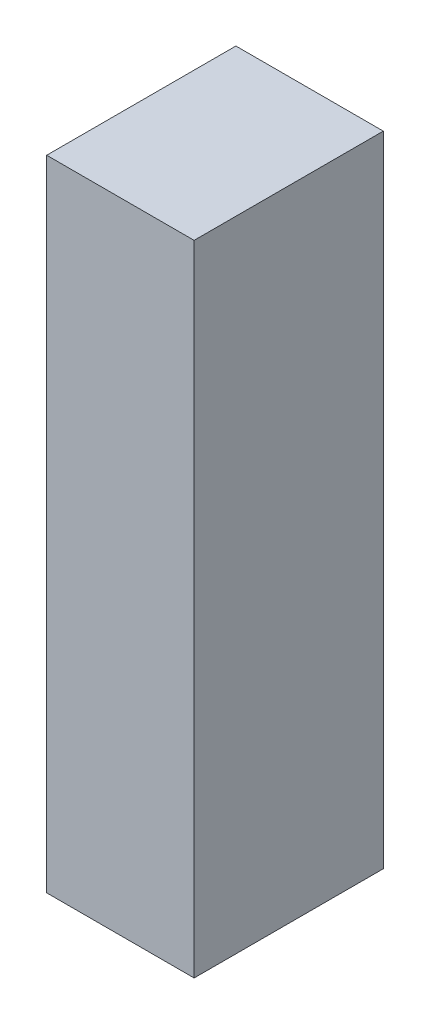
ISO-10303-21;
HEADER;
FILE_DESCRIPTION(('STEP AP214'),'2;1');
FILE_NAME('part.step','',(''),(''),'','','');
FILE_SCHEMA(('AUTOMOTIVE_DESIGN { 1 0 10303 214 1 1 1 1 }'));
ENDSEC;
DATA;
#1=APPLICATION_CONTEXT('core data for automotive mechanical design processes');
#2=APPLICATION_PROTOCOL_DEFINITION('international standard','automotive_design',2000,#1);
#3=PRODUCT_CONTEXT('',#1,'mechanical');
#4=PRODUCT('Part','Part','',(#3));
#5=PRODUCT_RELATED_PRODUCT_CATEGORY('part','',(#4));
#6=PRODUCT_DEFINITION_FORMATION('','',#4);
#7=PRODUCT_DEFINITION_CONTEXT('part definition',#1,'design');
#8=PRODUCT_DEFINITION('design','',#6,#7);
#9=PRODUCT_DEFINITION_SHAPE('','',#8);
#10=(LENGTH_UNIT() NAMED_UNIT(*) SI_UNIT(.MILLI.,.METRE.));
#11=(NAMED_UNIT(*) PLANE_ANGLE_UNIT() SI_UNIT($,.RADIAN.));
#12=(NAMED_UNIT(*) SI_UNIT($,.STERADIAN.) SOLID_ANGLE_UNIT());
#13=UNCERTAINTY_MEASURE_WITH_UNIT(LENGTH_MEASURE(1.E-05),#10,'distance_accuracy_value','');
#14=(GEOMETRIC_REPRESENTATION_CONTEXT(3) GLOBAL_UNCERTAINTY_ASSIGNED_CONTEXT((#13)) GLOBAL_UNIT_ASSIGNED_CONTEXT((#10,
#11,#12)) REPRESENTATION_CONTEXT('',''));
#15=CARTESIAN_POINT('',(0.,0.,0.));
#16=DIRECTION('',(0.,0.,1.));
#17=DIRECTION('',(1.,0.,0.));
#18=AXIS2_PLACEMENT_3D('',#15,#16,#17);
#19=CARTESIAN_POINT('',(-150.,1300.,-192.5));
#20=DIRECTION('',(1.,0.,0.));
#21=DIRECTION('',(0.,0.,-1.));
#22=AXIS2_PLACEMENT_3D('',#19,#20,#21);
#23=PLANE('',#22);
#24=DIRECTION('',(0.,0.,1.));
#25=VECTOR('',#24,1.);
#26=CARTESIAN_POINT('',(-150.,0.,-192.5));
#27=LINE('',#26,#25);
#28=CARTESIAN_POINT('',(-150.,0.,-192.5));
#29=VERTEX_POINT('',#28);
#30=CARTESIAN_POINT('',(-150.,0.,192.5));
#31=VERTEX_POINT('',#30);
#32=EDGE_CURVE('E111',#29,#31,#27,.T.);
#33=ORIENTED_EDGE('',*,*,#32,.T.);
#34=DIRECTION('',(0.,-1.,0.));
#35=VECTOR('',#34,1.);
#36=CARTESIAN_POINT('',(-150.,1300.,192.5));
#37=LINE('',#36,#35);
#38=CARTESIAN_POINT('',(-150.,1300.,192.5));
#39=VERTEX_POINT('',#38);
#40=EDGE_CURVE('E11',#39,#31,#37,.T.);
#41=ORIENTED_EDGE('',*,*,#40,.F.);
#42=DIRECTION('',(0.,0.,1.));
#43=VECTOR('',#42,1.);
#44=CARTESIAN_POINT('',(-150.,1300.,-192.5));
#45=LINE('',#44,#43);
#46=CARTESIAN_POINT('',(-150.,1300.,-192.5));
#47=VERTEX_POINT('',#46);
#48=EDGE_CURVE('E95',#47,#39,#45,.T.);
#49=ORIENTED_EDGE('',*,*,#48,.F.);
#50=DIRECTION('',(0.,-1.,0.));
#51=VECTOR('',#50,1.);
#52=CARTESIAN_POINT('',(-150.,1300.,-192.5));
#53=LINE('',#52,#51);
#54=EDGE_CURVE('E107',#47,#29,#53,.T.);
#55=ORIENTED_EDGE('',*,*,#54,.T.);
#56=EDGE_LOOP('',(#33,#41,#49,#55));
#57=FACE_BOUND('',#56,.T.);
#58=ADVANCED_FACE('F43',(#57),#23,.F.);
#59=CARTESIAN_POINT('',(150.,1300.,192.5));
#60=DIRECTION('',(0.,0.,-1.));
#61=DIRECTION('',(-1.,0.,0.));
#62=AXIS2_PLACEMENT_3D('',#59,#60,#61);
#63=PLANE('',#62);
#64=DIRECTION('',(1.,0.,0.));
#65=VECTOR('',#64,1.);
#66=CARTESIAN_POINT('',(150.,0.,192.5));
#67=LINE('',#66,#65);
#68=CARTESIAN_POINT('',(150.,0.,192.5));
#69=VERTEX_POINT('',#68);
#70=EDGE_CURVE('E100',#31,#69,#67,.T.);
#71=ORIENTED_EDGE('',*,*,#70,.T.);
#72=DIRECTION('',(0.,-1.,0.));
#73=VECTOR('',#72,1.);
#74=CARTESIAN_POINT('',(150.,1300.,192.5));
#75=LINE('',#74,#73);
#76=CARTESIAN_POINT('',(150.,1300.,192.5));
#77=VERTEX_POINT('',#76);
#78=EDGE_CURVE('E52',#77,#69,#75,.T.);
#79=ORIENTED_EDGE('',*,*,#78,.F.);
#80=DIRECTION('',(1.,0.,0.));
#81=VECTOR('',#80,1.);
#82=CARTESIAN_POINT('',(150.,1300.,192.5));
#83=LINE('',#82,#81);
#84=EDGE_CURVE('E90',#39,#77,#83,.T.);
#85=ORIENTED_EDGE('',*,*,#84,.F.);
#86=ORIENTED_EDGE('',*,*,#40,.T.);
#87=EDGE_LOOP('',(#71,#79,#85,#86));
#88=FACE_BOUND('',#87,.T.);
#89=ADVANCED_FACE('F99',(#88),#63,.F.);
#90=CARTESIAN_POINT('',(150.,1300.,-192.5));
#91=DIRECTION('',(-1.,0.,0.));
#92=DIRECTION('',(0.,0.,1.));
#93=AXIS2_PLACEMENT_3D('',#90,#91,#92);
#94=PLANE('',#93);
#95=DIRECTION('',(0.,0.,-1.));
#96=VECTOR('',#95,1.);
#97=CARTESIAN_POINT('',(150.,0.,-192.5));
#98=LINE('',#97,#96);
#99=CARTESIAN_POINT('',(150.,0.,-192.5));
#100=VERTEX_POINT('',#99);
#101=EDGE_CURVE('E77',#69,#100,#98,.T.);
#102=ORIENTED_EDGE('',*,*,#101,.T.);
#103=DIRECTION('',(0.,-1.,0.));
#104=VECTOR('',#103,1.);
#105=CARTESIAN_POINT('',(150.,1300.,-192.5));
#106=LINE('',#105,#104);
#107=CARTESIAN_POINT('',(150.,1300.,-192.5));
#108=VERTEX_POINT('',#107);
#109=EDGE_CURVE('E102',#108,#100,#106,.T.);
#110=ORIENTED_EDGE('',*,*,#109,.F.);
#111=DIRECTION('',(0.,0.,-1.));
#112=VECTOR('',#111,1.);
#113=CARTESIAN_POINT('',(150.,1300.,-192.5));
#114=LINE('',#113,#112);
#115=EDGE_CURVE('E93',#77,#108,#114,.T.);
#116=ORIENTED_EDGE('',*,*,#115,.F.);
#117=ORIENTED_EDGE('',*,*,#78,.T.);
#118=EDGE_LOOP('',(#102,#110,#116,#117));
#119=FACE_BOUND('',#118,.T.);
#120=ADVANCED_FACE('F103',(#119),#94,.F.);
#121=CARTESIAN_POINT('',(150.,1300.,-192.5));
#122=DIRECTION('',(0.,0.,1.));
#123=DIRECTION('',(1.,0.,0.));
#124=AXIS2_PLACEMENT_3D('',#121,#122,#123);
#125=PLANE('',#124);
#126=DIRECTION('',(-1.,0.,0.));
#127=VECTOR('',#126,1.);
#128=CARTESIAN_POINT('',(150.,0.,-192.5));
#129=LINE('',#128,#127);
#130=EDGE_CURVE('E83',#100,#29,#129,.T.);
#131=ORIENTED_EDGE('',*,*,#130,.T.);
#132=ORIENTED_EDGE('',*,*,#54,.F.);
#133=DIRECTION('',(-1.,0.,0.));
#134=VECTOR('',#133,1.);
#135=CARTESIAN_POINT('',(150.,1300.,-192.5));
#136=LINE('',#135,#134);
#137=EDGE_CURVE('E60',#108,#47,#136,.T.);
#138=ORIENTED_EDGE('',*,*,#137,.F.);
#139=ORIENTED_EDGE('',*,*,#109,.T.);
#140=EDGE_LOOP('',(#131,#132,#138,#139));
#141=FACE_BOUND('',#140,.T.);
#142=ADVANCED_FACE('F124',(#141),#125,.F.);
#143=CARTESIAN_POINT('',(0.,1300.,0.));
#144=DIRECTION('',(0.,-1.,0.));
#145=DIRECTION('',(0.,0.,-1.));
#146=AXIS2_PLACEMENT_3D('',#143,#144,#145);
#147=PLANE('',#146);
#148=ORIENTED_EDGE('',*,*,#48,.T.);
#149=ORIENTED_EDGE('',*,*,#84,.T.);
#150=ORIENTED_EDGE('',*,*,#115,.T.);
#151=ORIENTED_EDGE('',*,*,#137,.T.);
#152=EDGE_LOOP('',(#148,#149,#150,#151));
#153=FACE_BOUND('',#152,.T.);
#154=ADVANCED_FACE('F91',(#153),#147,.F.);
#155=CARTESIAN_POINT('',(0.,0.,0.));
#156=DIRECTION('',(0.,-1.,0.));
#157=DIRECTION('',(0.,0.,-1.));
#158=AXIS2_PLACEMENT_3D('',#155,#156,#157);
#159=PLANE('',#158);
#160=ORIENTED_EDGE('',*,*,#32,.F.);
#161=ORIENTED_EDGE('',*,*,#130,.F.);
#162=ORIENTED_EDGE('',*,*,#101,.F.);
#163=ORIENTED_EDGE('',*,*,#70,.F.);
#164=EDGE_LOOP('',(#160,#161,#162,#163));
#165=FACE_BOUND('',#164,.T.);
#166=ADVANCED_FACE('F127',(#165),#159,.T.);
#167=CLOSED_SHELL('',(#58,#89,#120,#142,#154,#166));
#168=MANIFOLD_SOLID_BREP('B2',#167);
#169=ADVANCED_BREP_SHAPE_REPRESENTATION('',(#18,#168),#14);
#170=SHAPE_DEFINITION_REPRESENTATION(#9,#169);
ENDSEC;
END-ISO-10303-21;
